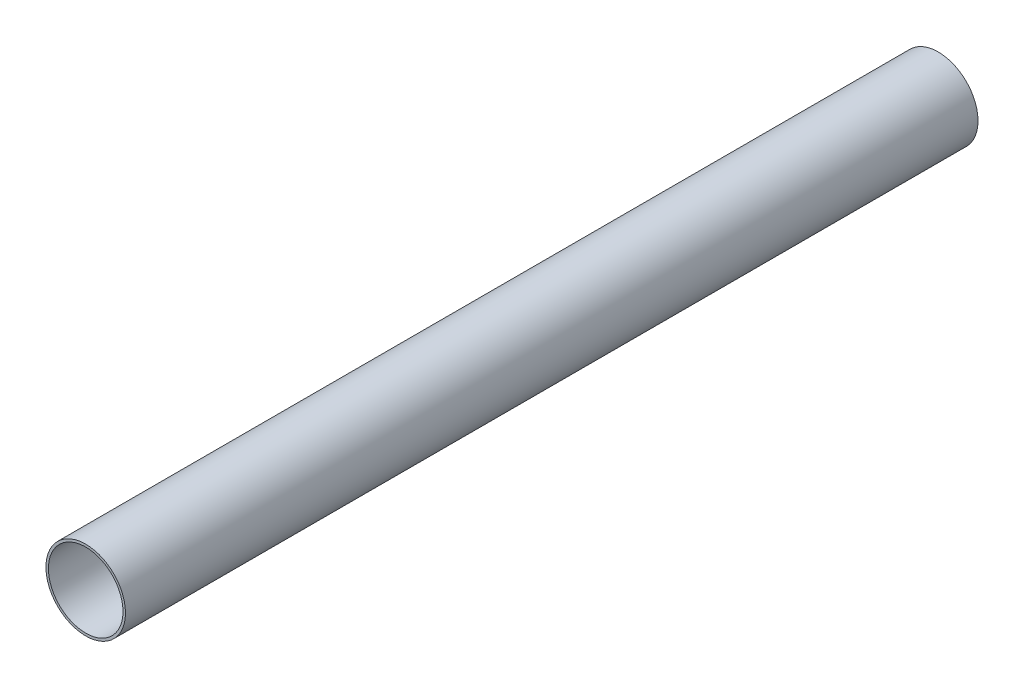
ISO-10303-21;
HEADER;
FILE_DESCRIPTION(('STEP AP214'),'2;1');
FILE_NAME('part.step','',(''),(''),'','','');
FILE_SCHEMA(('AUTOMOTIVE_DESIGN { 1 0 10303 214 1 1 1 1 }'));
ENDSEC;
DATA;
#1=APPLICATION_CONTEXT('core data for automotive mechanical design processes');
#2=APPLICATION_PROTOCOL_DEFINITION('international standard','automotive_design',2000,#1);
#3=PRODUCT_CONTEXT('',#1,'mechanical');
#4=PRODUCT('Part','Part','',(#3));
#5=PRODUCT_RELATED_PRODUCT_CATEGORY('part','',(#4));
#6=PRODUCT_DEFINITION_FORMATION('','',#4);
#7=PRODUCT_DEFINITION_CONTEXT('part definition',#1,'design');
#8=PRODUCT_DEFINITION('design','',#6,#7);
#9=PRODUCT_DEFINITION_SHAPE('','',#8);
#10=(LENGTH_UNIT() NAMED_UNIT(*) SI_UNIT(.MILLI.,.METRE.));
#11=(NAMED_UNIT(*) PLANE_ANGLE_UNIT() SI_UNIT($,.RADIAN.));
#12=(NAMED_UNIT(*) SI_UNIT($,.STERADIAN.) SOLID_ANGLE_UNIT());
#13=UNCERTAINTY_MEASURE_WITH_UNIT(LENGTH_MEASURE(1.E-05),#10,'distance_accuracy_value','');
#14=(GEOMETRIC_REPRESENTATION_CONTEXT(3) GLOBAL_UNCERTAINTY_ASSIGNED_CONTEXT((#13)) GLOBAL_UNIT_ASSIGNED_CONTEXT((#10,
#11,#12)) REPRESENTATION_CONTEXT('',''));
#15=CARTESIAN_POINT('',(0.,0.,0.));
#16=DIRECTION('',(0.,0.,1.));
#17=DIRECTION('',(1.,0.,0.));
#18=AXIS2_PLACEMENT_3D('',#15,#16,#17);
#19=CARTESIAN_POINT('',(0.,0.,508.));
#20=DIRECTION('',(0.,0.,1.));
#21=DIRECTION('',(1.,0.,0.));
#22=AXIS2_PLACEMENT_3D('',#19,#20,#21);
#23=PLANE('',#22);
#24=CARTESIAN_POINT('',(0.,0.,508.));
#25=DIRECTION('',(0.,0.,1.));
#26=DIRECTION('',(1.,0.,0.));
#27=AXIS2_PLACEMENT_3D('',#24,#25,#26);
#28=CIRCLE('',#27,23.6982);
#29=CARTESIAN_POINT('',(23.6982,0.,508.));
#30=VERTEX_POINT('',#29);
#31=EDGE_CURVE('E10',#30,#30,#28,.T.);
#32=ORIENTED_EDGE('',*,*,#31,.T.);
#33=EDGE_LOOP('',(#32));
#34=FACE_BOUND('',#33,.T.);
#35=CARTESIAN_POINT('',(0.,0.,508.));
#36=DIRECTION('',(0.,0.,1.));
#37=DIRECTION('',(1.,0.,0.));
#38=AXIS2_PLACEMENT_3D('',#35,#36,#37);
#39=CIRCLE('',#38,22.225);
#40=CARTESIAN_POINT('',(22.225,0.,508.));
#41=VERTEX_POINT('',#40);
#42=EDGE_CURVE('E44',#41,#41,#39,.T.);
#43=ORIENTED_EDGE('',*,*,#42,.F.);
#44=EDGE_LOOP('',(#43));
#45=FACE_BOUND('',#44,.T.);
#46=ADVANCED_FACE('F33',(#34,#45),#23,.T.);
#47=CARTESIAN_POINT('',(0.,0.,0.));
#48=DIRECTION('',(0.,0.,1.));
#49=DIRECTION('',(1.,0.,0.));
#50=AXIS2_PLACEMENT_3D('',#47,#48,#49);
#51=PLANE('',#50);
#52=CARTESIAN_POINT('',(0.,0.,0.));
#53=DIRECTION('',(0.,0.,1.));
#54=DIRECTION('',(1.,0.,0.));
#55=AXIS2_PLACEMENT_3D('',#52,#53,#54);
#56=CIRCLE('',#55,23.6982);
#57=CARTESIAN_POINT('',(23.6982,0.,0.));
#58=VERTEX_POINT('',#57);
#59=EDGE_CURVE('E37',#58,#58,#56,.T.);
#60=ORIENTED_EDGE('',*,*,#59,.F.);
#61=EDGE_LOOP('',(#60));
#62=FACE_BOUND('',#61,.T.);
#63=CARTESIAN_POINT('',(0.,0.,0.));
#64=DIRECTION('',(0.,0.,1.));
#65=DIRECTION('',(1.,0.,0.));
#66=AXIS2_PLACEMENT_3D('',#63,#64,#65);
#67=CIRCLE('',#66,22.225);
#68=CARTESIAN_POINT('',(22.225,0.,0.));
#69=VERTEX_POINT('',#68);
#70=EDGE_CURVE('E46',#69,#69,#67,.T.);
#71=ORIENTED_EDGE('',*,*,#70,.T.);
#72=EDGE_LOOP('',(#71));
#73=FACE_BOUND('',#72,.T.);
#74=ADVANCED_FACE('F56',(#62,#73),#51,.F.);
#75=CARTESIAN_POINT('',(0.,0.,508.));
#76=DIRECTION('',(0.,0.,-1.));
#77=DIRECTION('',(-1.,0.,0.));
#78=AXIS2_PLACEMENT_3D('',#75,#76,#77);
#79=CYLINDRICAL_SURFACE('',#78,23.6982);
#80=ORIENTED_EDGE('',*,*,#31,.F.);
#81=EDGE_LOOP('',(#80));
#82=FACE_BOUND('',#81,.T.);
#83=ORIENTED_EDGE('',*,*,#59,.T.);
#84=EDGE_LOOP('',(#83));
#85=FACE_BOUND('',#84,.T.);
#86=ADVANCED_FACE('F35',(#82,#85),#79,.T.);
#87=CARTESIAN_POINT('',(0.,0.,508.));
#88=DIRECTION('',(0.,0.,-1.));
#89=DIRECTION('',(-1.,0.,0.));
#90=AXIS2_PLACEMENT_3D('',#87,#88,#89);
#91=CYLINDRICAL_SURFACE('',#90,22.225);
#92=ORIENTED_EDGE('',*,*,#42,.T.);
#93=EDGE_LOOP('',(#92));
#94=FACE_BOUND('',#93,.T.);
#95=ORIENTED_EDGE('',*,*,#70,.F.);
#96=EDGE_LOOP('',(#95));
#97=FACE_BOUND('',#96,.T.);
#98=ADVANCED_FACE('F52',(#94,#97),#91,.F.);
#99=CLOSED_SHELL('',(#46,#74,#86,#98));
#100=MANIFOLD_SOLID_BREP('B2',#99);
#101=ADVANCED_BREP_SHAPE_REPRESENTATION('',(#18,#100),#14);
#102=SHAPE_DEFINITION_REPRESENTATION(#9,#101);
ENDSEC;
END-ISO-10303-21;
